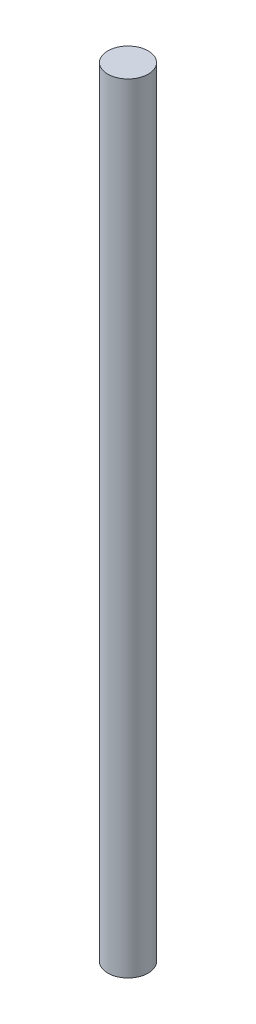
ISO-10303-21;
HEADER;
FILE_DESCRIPTION(('STEP AP214'),'2;1');
FILE_NAME('part.step','',(''),(''),'','','');
FILE_SCHEMA(('AUTOMOTIVE_DESIGN { 1 0 10303 214 1 1 1 1 }'));
ENDSEC;
DATA;
#1=APPLICATION_CONTEXT('core data for automotive mechanical design processes');
#2=APPLICATION_PROTOCOL_DEFINITION('international standard','automotive_design',2000,#1);
#3=PRODUCT_CONTEXT('',#1,'mechanical');
#4=PRODUCT('Part','Part','',(#3));
#5=PRODUCT_RELATED_PRODUCT_CATEGORY('part','',(#4));
#6=PRODUCT_DEFINITION_FORMATION('','',#4);
#7=PRODUCT_DEFINITION_CONTEXT('part definition',#1,'design');
#8=PRODUCT_DEFINITION('design','',#6,#7);
#9=PRODUCT_DEFINITION_SHAPE('','',#8);
#10=(LENGTH_UNIT() NAMED_UNIT(*) SI_UNIT(.MILLI.,.METRE.));
#11=(NAMED_UNIT(*) PLANE_ANGLE_UNIT() SI_UNIT($,.RADIAN.));
#12=(NAMED_UNIT(*) SI_UNIT($,.STERADIAN.) SOLID_ANGLE_UNIT());
#13=UNCERTAINTY_MEASURE_WITH_UNIT(LENGTH_MEASURE(1.E-05),#10,'distance_accuracy_value','');
#14=(GEOMETRIC_REPRESENTATION_CONTEXT(3) GLOBAL_UNCERTAINTY_ASSIGNED_CONTEXT((#13)) GLOBAL_UNIT_ASSIGNED_CONTEXT((#10,
#11,#12)) REPRESENTATION_CONTEXT('',''));
#15=CARTESIAN_POINT('',(0.,0.,0.));
#16=DIRECTION('',(0.,0.,1.));
#17=DIRECTION('',(1.,0.,0.));
#18=AXIS2_PLACEMENT_3D('',#15,#16,#17);
#19=CARTESIAN_POINT('',(0.,38.55,0.));
#20=DIRECTION('',(0.,-1.,0.));
#21=DIRECTION('',(0.,0.,-1.));
#22=AXIS2_PLACEMENT_3D('',#19,#20,#21);
#23=CYLINDRICAL_SURFACE('',#22,1.);
#24=CARTESIAN_POINT('',(0.,38.55,0.));
#25=DIRECTION('',(0.,1.,0.));
#26=DIRECTION('',(0.,0.,1.));
#27=AXIS2_PLACEMENT_3D('',#24,#25,#26);
#28=CIRCLE('',#27,1.);
#29=CARTESIAN_POINT('',(0.,38.55,1.));
#30=VERTEX_POINT('',#29);
#31=EDGE_CURVE('E10',#30,#30,#28,.T.);
#32=ORIENTED_EDGE('',*,*,#31,.F.);
#33=EDGE_LOOP('',(#32));
#34=FACE_BOUND('',#33,.T.);
#35=CARTESIAN_POINT('',(0.,0.,0.));
#36=DIRECTION('',(0.,1.,0.));
#37=DIRECTION('',(0.,0.,1.));
#38=AXIS2_PLACEMENT_3D('',#35,#36,#37);
#39=CIRCLE('',#38,1.);
#40=CARTESIAN_POINT('',(0.,0.,1.));
#41=VERTEX_POINT('',#40);
#42=EDGE_CURVE('E46',#41,#41,#39,.T.);
#43=ORIENTED_EDGE('',*,*,#42,.T.);
#44=EDGE_LOOP('',(#43));
#45=FACE_BOUND('',#44,.T.);
#46=ADVANCED_FACE('F43',(#34,#45),#23,.T.);
#47=CARTESIAN_POINT('',(0.,38.55,0.));
#48=DIRECTION('',(0.,1.,0.));
#49=DIRECTION('',(0.,0.,1.));
#50=AXIS2_PLACEMENT_3D('',#47,#48,#49);
#51=PLANE('',#50);
#52=ORIENTED_EDGE('',*,*,#31,.T.);
#53=EDGE_LOOP('',(#52));
#54=FACE_BOUND('',#53,.T.);
#55=ADVANCED_FACE('F60',(#54),#51,.T.);
#56=CARTESIAN_POINT('',(0.,0.,0.));
#57=DIRECTION('',(0.,1.,0.));
#58=DIRECTION('',(0.,0.,1.));
#59=AXIS2_PLACEMENT_3D('',#56,#57,#58);
#60=PLANE('',#59);
#61=ORIENTED_EDGE('',*,*,#42,.F.);
#62=EDGE_LOOP('',(#61));
#63=FACE_BOUND('',#62,.T.);
#64=ADVANCED_FACE('F58',(#63),#60,.F.);
#65=CLOSED_SHELL('',(#46,#55,#64));
#66=MANIFOLD_SOLID_BREP('B2',#65);
#67=ADVANCED_BREP_SHAPE_REPRESENTATION('',(#18,#66),#14);
#68=SHAPE_DEFINITION_REPRESENTATION(#9,#67);
ENDSEC;
END-ISO-10303-21;
